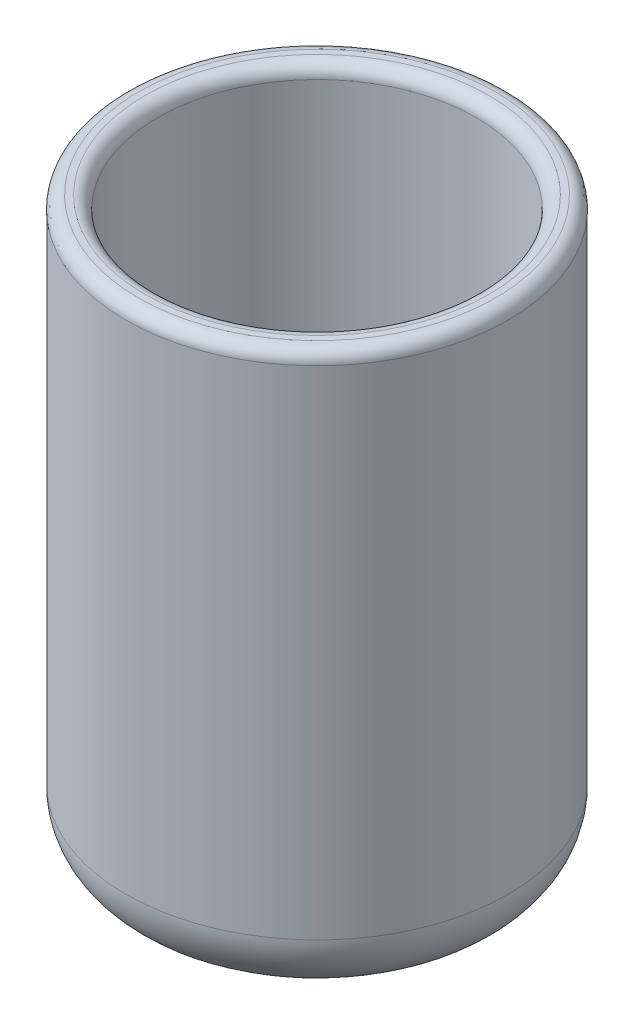
ISO-10303-21;
HEADER;
FILE_DESCRIPTION(('STEP AP214'),'2;1');
FILE_NAME('part.step','',(''),(''),'','','');
FILE_SCHEMA(('AUTOMOTIVE_DESIGN { 1 0 10303 214 1 1 1 1 }'));
ENDSEC;
DATA;
#1=APPLICATION_CONTEXT('core data for automotive mechanical design processes');
#2=APPLICATION_PROTOCOL_DEFINITION('international standard','automotive_design',2000,#1);
#3=PRODUCT_CONTEXT('',#1,'mechanical');
#4=PRODUCT('Part','Part','',(#3));
#5=PRODUCT_RELATED_PRODUCT_CATEGORY('part','',(#4));
#6=PRODUCT_DEFINITION_FORMATION('','',#4);
#7=PRODUCT_DEFINITION_CONTEXT('part definition',#1,'design');
#8=PRODUCT_DEFINITION('design','',#6,#7);
#9=PRODUCT_DEFINITION_SHAPE('','',#8);
#10=(LENGTH_UNIT() NAMED_UNIT(*) SI_UNIT(.MILLI.,.METRE.));
#11=(NAMED_UNIT(*) PLANE_ANGLE_UNIT() SI_UNIT($,.RADIAN.));
#12=(NAMED_UNIT(*) SI_UNIT($,.STERADIAN.) SOLID_ANGLE_UNIT());
#13=UNCERTAINTY_MEASURE_WITH_UNIT(LENGTH_MEASURE(1.E-05),#10,'distance_accuracy_value','');
#14=(GEOMETRIC_REPRESENTATION_CONTEXT(3) GLOBAL_UNCERTAINTY_ASSIGNED_CONTEXT((#13)) GLOBAL_UNIT_ASSIGNED_CONTEXT((#10,
#11,#12)) REPRESENTATION_CONTEXT('',''));
#15=CARTESIAN_POINT('',(0.,0.,0.));
#16=DIRECTION('',(0.,0.,1.));
#17=DIRECTION('',(1.,0.,0.));
#18=AXIS2_PLACEMENT_3D('',#15,#16,#17);
#19=CARTESIAN_POINT('',(0.,114.3,0.));
#20=DIRECTION('',(0.,-1.,0.));
#21=DIRECTION('',(0.,0.,-1.));
#22=AXIS2_PLACEMENT_3D('',#19,#20,#21);
#23=CYLINDRICAL_SURFACE('',#22,38.1);
#24=CARTESIAN_POINT('',(0.,12.7,0.));
#25=DIRECTION('',(0.,1.,0.));
#26=DIRECTION('',(0.,0.,1.));
#27=AXIS2_PLACEMENT_3D('',#24,#25,#26);
#28=CIRCLE('',#27,38.1);
#29=CARTESIAN_POINT('',(0.,12.7,38.1));
#30=VERTEX_POINT('',#29);
#31=EDGE_CURVE('E53',#30,#30,#28,.T.);
#32=ORIENTED_EDGE('',*,*,#31,.T.);
#33=EDGE_LOOP('',(#32));
#34=FACE_BOUND('',#33,.T.);
#35=CARTESIAN_POINT('',(0.,111.76,0.));
#36=DIRECTION('',(0.,1.,0.));
#37=DIRECTION('',(0.,0.,1.));
#38=AXIS2_PLACEMENT_3D('',#35,#36,#37);
#39=CIRCLE('',#38,38.1);
#40=CARTESIAN_POINT('',(0.,111.76,38.1));
#41=VERTEX_POINT('',#40);
#42=EDGE_CURVE('E63',#41,#41,#39,.F.);
#43=ORIENTED_EDGE('',*,*,#42,.T.);
#44=EDGE_LOOP('',(#43));
#45=FACE_BOUND('',#44,.T.);
#46=ADVANCED_FACE('F45',(#34,#45),#23,.T.);
#47=CARTESIAN_POINT('',(0.,114.3,0.));
#48=DIRECTION('',(0.,1.,0.));
#49=DIRECTION('',(0.,0.,1.));
#50=AXIS2_PLACEMENT_3D('',#47,#48,#49);
#51=PLANE('',#50);
#52=CARTESIAN_POINT('',(0.,114.3,0.));
#53=DIRECTION('',(0.,1.,0.));
#54=DIRECTION('',(0.,0.,1.));
#55=AXIS2_PLACEMENT_3D('',#52,#53,#54);
#56=CIRCLE('',#55,35.56);
#57=CARTESIAN_POINT('',(0.,114.3,35.56));
#58=VERTEX_POINT('',#57);
#59=EDGE_CURVE('E69',#58,#58,#56,.T.);
#60=ORIENTED_EDGE('',*,*,#59,.T.);
#61=EDGE_LOOP('',(#60));
#62=FACE_BOUND('',#61,.T.);
#63=CARTESIAN_POINT('',(0.,114.3,0.));
#64=DIRECTION('',(0.,1.,0.));
#65=DIRECTION('',(0.,0.,1.));
#66=AXIS2_PLACEMENT_3D('',#63,#64,#65);
#67=CIRCLE('',#66,34.29);
#68=CARTESIAN_POINT('',(0.,114.3,34.29));
#69=VERTEX_POINT('',#68);
#70=EDGE_CURVE('E73',#69,#69,#67,.F.);
#71=ORIENTED_EDGE('',*,*,#70,.T.);
#72=EDGE_LOOP('',(#71));
#73=FACE_BOUND('',#72,.T.);
#74=ADVANCED_FACE('F97',(#62,#73),#51,.T.);
#75=CARTESIAN_POINT('',(0.,0.,0.));
#76=DIRECTION('',(0.,1.,0.));
#77=DIRECTION('',(0.,0.,1.));
#78=AXIS2_PLACEMENT_3D('',#75,#76,#77);
#79=PLANE('',#78);
#80=CARTESIAN_POINT('',(0.,0.,0.));
#81=DIRECTION('',(0.,1.,0.));
#82=DIRECTION('',(0.,0.,1.));
#83=AXIS2_PLACEMENT_3D('',#80,#81,#82);
#84=CIRCLE('',#83,25.4);
#85=CARTESIAN_POINT('',(0.,0.,25.4));
#86=VERTEX_POINT('',#85);
#87=EDGE_CURVE('E10',#86,#86,#84,.F.);
#88=ORIENTED_EDGE('',*,*,#87,.T.);
#89=EDGE_LOOP('',(#88));
#90=FACE_BOUND('',#89,.T.);
#91=ADVANCED_FACE('F86',(#90),#79,.F.);
#92=CARTESIAN_POINT('',(0.,6.34999999999999,0.));
#93=DIRECTION('',(0.,1.,0.));
#94=DIRECTION('',(0.,0.,1.));
#95=AXIS2_PLACEMENT_3D('',#92,#93,#94);
#96=CYLINDRICAL_SURFACE('',#95,31.75);
#97=CARTESIAN_POINT('',(0.,111.76,0.));
#98=DIRECTION('',(0.,1.,0.));
#99=DIRECTION('',(0.,0.,1.));
#100=AXIS2_PLACEMENT_3D('',#97,#98,#99);
#101=CIRCLE('',#100,31.75);
#102=CARTESIAN_POINT('',(0.,111.76,31.75));
#103=VERTEX_POINT('',#102);
#104=EDGE_CURVE('E58',#103,#103,#101,.T.);
#105=ORIENTED_EDGE('',*,*,#104,.T.);
#106=EDGE_LOOP('',(#105));
#107=FACE_BOUND('',#106,.T.);
#108=CARTESIAN_POINT('',(0.,6.34999999999999,0.));
#109=DIRECTION('',(0.,1.,0.));
#110=DIRECTION('',(0.,0.,1.));
#111=AXIS2_PLACEMENT_3D('',#108,#109,#110);
#112=CIRCLE('',#111,31.75);
#113=CARTESIAN_POINT('',(0.,6.34999999999999,31.75));
#114=VERTEX_POINT('',#113);
#115=EDGE_CURVE('E77',#114,#114,#112,.T.);
#116=ORIENTED_EDGE('',*,*,#115,.F.);
#117=EDGE_LOOP('',(#116));
#118=FACE_BOUND('',#117,.T.);
#119=ADVANCED_FACE('F84',(#107,#118),#96,.F.);
#120=CARTESIAN_POINT('',(0.,6.34999999999999,0.));
#121=DIRECTION('',(0.,1.,0.));
#122=DIRECTION('',(0.,0.,1.));
#123=AXIS2_PLACEMENT_3D('',#120,#121,#122);
#124=PLANE('',#123);
#125=ORIENTED_EDGE('',*,*,#115,.T.);
#126=EDGE_LOOP('',(#125));
#127=FACE_BOUND('',#126,.T.);
#128=ADVANCED_FACE('F82',(#127),#124,.T.);
#129=CARTESIAN_POINT('',(0.,111.76,0.));
#130=DIRECTION('',(0.,1.,0.));
#131=DIRECTION('',(0.,0.,1.));
#132=AXIS2_PLACEMENT_3D('',#129,#130,#131);
#133=TOROIDAL_SURFACE('',#132,35.56,2.54);
#134=ORIENTED_EDGE('',*,*,#42,.F.);
#135=EDGE_LOOP('',(#134));
#136=FACE_BOUND('',#135,.T.);
#137=ORIENTED_EDGE('',*,*,#59,.F.);
#138=EDGE_LOOP('',(#137));
#139=FACE_BOUND('',#138,.T.);
#140=ADVANCED_FACE('F94',(#136,#139),#133,.T.);
#141=CARTESIAN_POINT('',(0.,111.76,0.));
#142=DIRECTION('',(0.,1.,0.));
#143=DIRECTION('',(0.,0.,1.));
#144=AXIS2_PLACEMENT_3D('',#141,#142,#143);
#145=TOROIDAL_SURFACE('',#144,34.29,2.54);
#146=ORIENTED_EDGE('',*,*,#70,.F.);
#147=EDGE_LOOP('',(#146));
#148=FACE_BOUND('',#147,.T.);
#149=ORIENTED_EDGE('',*,*,#104,.F.);
#150=EDGE_LOOP('',(#149));
#151=FACE_BOUND('',#150,.T.);
#152=ADVANCED_FACE('F108',(#148,#151),#145,.T.);
#153=CARTESIAN_POINT('',(0.,12.7,0.));
#154=DIRECTION('',(0.,1.,0.));
#155=DIRECTION('',(0.,0.,1.));
#156=AXIS2_PLACEMENT_3D('',#153,#154,#155);
#157=TOROIDAL_SURFACE('',#156,25.4,12.7);
#158=ORIENTED_EDGE('',*,*,#87,.F.);
#159=EDGE_LOOP('',(#158));
#160=FACE_BOUND('',#159,.T.);
#161=ORIENTED_EDGE('',*,*,#31,.F.);
#162=EDGE_LOOP('',(#161));
#163=FACE_BOUND('',#162,.T.);
#164=ADVANCED_FACE('F47',(#160,#163),#157,.T.);
#165=CLOSED_SHELL('',(#46,#74,#91,#119,#128,#140,#152,#164));
#166=MANIFOLD_SOLID_BREP('B2',#165);
#167=ADVANCED_BREP_SHAPE_REPRESENTATION('',(#18,#166),#14);
#168=SHAPE_DEFINITION_REPRESENTATION(#9,#167);
ENDSEC;
END-ISO-10303-21;
